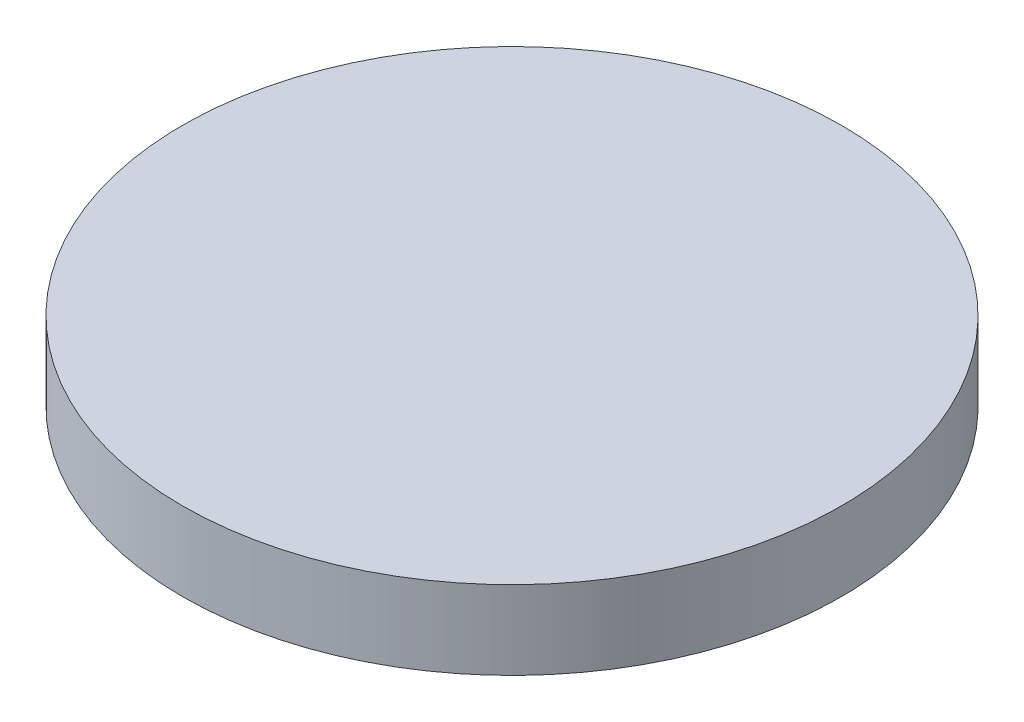
ISO-10303-21;
HEADER;
FILE_DESCRIPTION(('STEP AP214'),'2;1');
FILE_NAME('part.step','',(''),(''),'','','');
FILE_SCHEMA(('AUTOMOTIVE_DESIGN { 1 0 10303 214 1 1 1 1 }'));
ENDSEC;
DATA;
#1=APPLICATION_CONTEXT('core data for automotive mechanical design processes');
#2=APPLICATION_PROTOCOL_DEFINITION('international standard','automotive_design',2000,#1);
#3=PRODUCT_CONTEXT('',#1,'mechanical');
#4=PRODUCT('Part','Part','',(#3));
#5=PRODUCT_RELATED_PRODUCT_CATEGORY('part','',(#4));
#6=PRODUCT_DEFINITION_FORMATION('','',#4);
#7=PRODUCT_DEFINITION_CONTEXT('part definition',#1,'design');
#8=PRODUCT_DEFINITION('design','',#6,#7);
#9=PRODUCT_DEFINITION_SHAPE('','',#8);
#10=(LENGTH_UNIT() NAMED_UNIT(*) SI_UNIT(.MILLI.,.METRE.));
#11=(NAMED_UNIT(*) PLANE_ANGLE_UNIT() SI_UNIT($,.RADIAN.));
#12=(NAMED_UNIT(*) SI_UNIT($,.STERADIAN.) SOLID_ANGLE_UNIT());
#13=UNCERTAINTY_MEASURE_WITH_UNIT(LENGTH_MEASURE(1.E-05),#10,'distance_accuracy_value','');
#14=(GEOMETRIC_REPRESENTATION_CONTEXT(3) GLOBAL_UNCERTAINTY_ASSIGNED_CONTEXT((#13)) GLOBAL_UNIT_ASSIGNED_CONTEXT((#10,
#11,#12)) REPRESENTATION_CONTEXT('',''));
#15=CARTESIAN_POINT('',(0.,0.,0.));
#16=DIRECTION('',(0.,0.,1.));
#17=DIRECTION('',(1.,0.,0.));
#18=AXIS2_PLACEMENT_3D('',#15,#16,#17);
#19=CARTESIAN_POINT('',(0.,0.5,0.));
#20=DIRECTION('',(0.,-1.,0.));
#21=DIRECTION('',(0.,0.,-1.));
#22=AXIS2_PLACEMENT_3D('',#19,#20,#21);
#23=CYLINDRICAL_SURFACE('',#22,2.096);
#24=CARTESIAN_POINT('',(0.,0.5,0.));
#25=DIRECTION('',(0.,1.,0.));
#26=DIRECTION('',(0.,0.,1.));
#27=AXIS2_PLACEMENT_3D('',#24,#25,#26);
#28=CIRCLE('',#27,2.096);
#29=CARTESIAN_POINT('',(0.,0.5,2.096));
#30=VERTEX_POINT('',#29);
#31=EDGE_CURVE('E10',#30,#30,#28,.T.);
#32=ORIENTED_EDGE('',*,*,#31,.F.);
#33=EDGE_LOOP('',(#32));
#34=FACE_BOUND('',#33,.T.);
#35=CARTESIAN_POINT('',(0.,0.,0.));
#36=DIRECTION('',(0.,1.,0.));
#37=DIRECTION('',(0.,0.,1.));
#38=AXIS2_PLACEMENT_3D('',#35,#36,#37);
#39=CIRCLE('',#38,2.096);
#40=CARTESIAN_POINT('',(0.,0.,2.096));
#41=VERTEX_POINT('',#40);
#42=EDGE_CURVE('E40',#41,#41,#39,.T.);
#43=ORIENTED_EDGE('',*,*,#42,.T.);
#44=EDGE_LOOP('',(#43));
#45=FACE_BOUND('',#44,.T.);
#46=ADVANCED_FACE('F37',(#34,#45),#23,.T.);
#47=CARTESIAN_POINT('',(0.,0.5,0.));
#48=DIRECTION('',(0.,1.,0.));
#49=DIRECTION('',(0.,0.,1.));
#50=AXIS2_PLACEMENT_3D('',#47,#48,#49);
#51=PLANE('',#50);
#52=ORIENTED_EDGE('',*,*,#31,.T.);
#53=EDGE_LOOP('',(#52));
#54=FACE_BOUND('',#53,.T.);
#55=ADVANCED_FACE('F54',(#54),#51,.T.);
#56=CARTESIAN_POINT('',(0.,0.,0.));
#57=DIRECTION('',(0.,1.,0.));
#58=DIRECTION('',(0.,0.,1.));
#59=AXIS2_PLACEMENT_3D('',#56,#57,#58);
#60=PLANE('',#59);
#61=ORIENTED_EDGE('',*,*,#42,.F.);
#62=EDGE_LOOP('',(#61));
#63=FACE_BOUND('',#62,.T.);
#64=ADVANCED_FACE('F52',(#63),#60,.F.);
#65=CLOSED_SHELL('',(#46,#55,#64));
#66=MANIFOLD_SOLID_BREP('B2',#65);
#67=ADVANCED_BREP_SHAPE_REPRESENTATION('',(#18,#66),#14);
#68=SHAPE_DEFINITION_REPRESENTATION(#9,#67);
ENDSEC;
END-ISO-10303-21;
